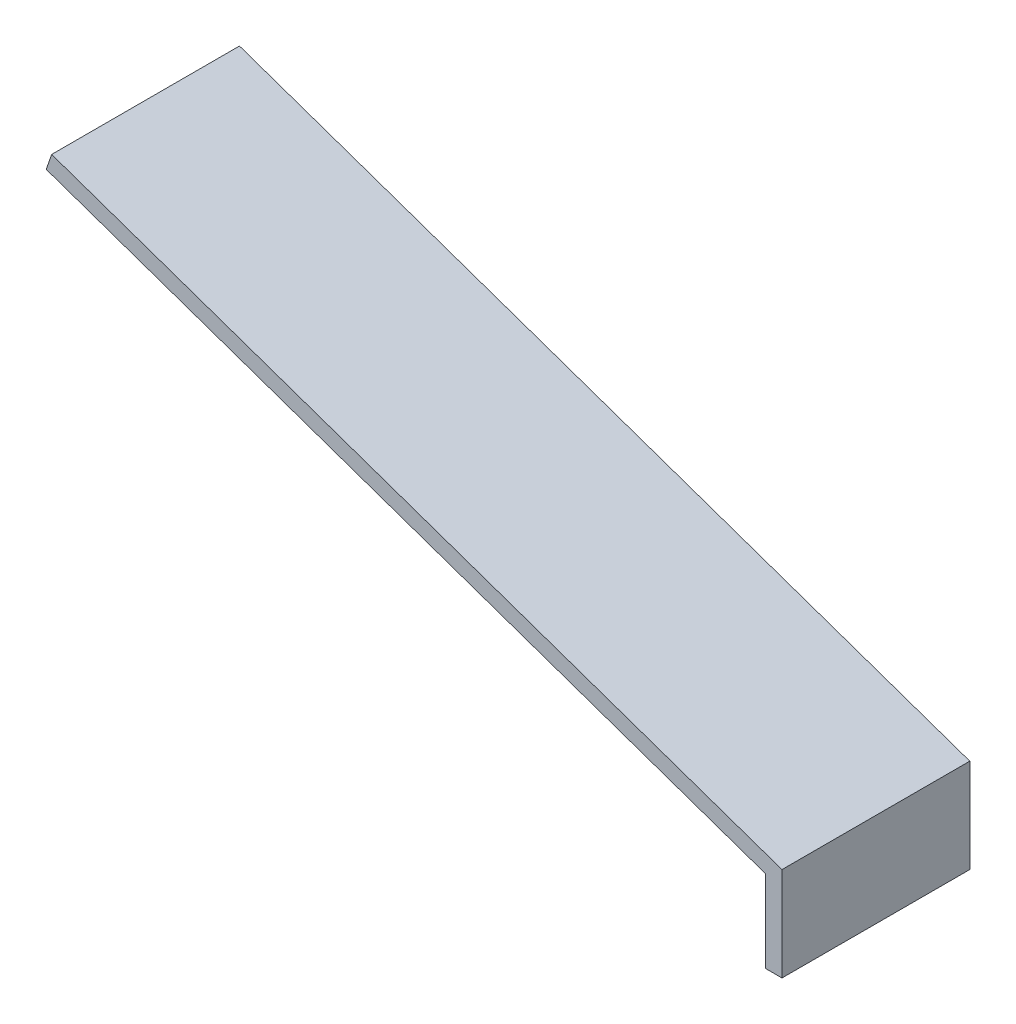
ISO-10303-21;
HEADER;
FILE_DESCRIPTION(('STEP AP214'),'2;1');
FILE_NAME('part.step','',(''),(''),'','','');
FILE_SCHEMA(('AUTOMOTIVE_DESIGN { 1 0 10303 214 1 1 1 1 }'));
ENDSEC;
DATA;
#1=APPLICATION_CONTEXT('core data for automotive mechanical design processes');
#2=APPLICATION_PROTOCOL_DEFINITION('international standard','automotive_design',2000,#1);
#3=PRODUCT_CONTEXT('',#1,'mechanical');
#4=PRODUCT('Part','Part','',(#3));
#5=PRODUCT_RELATED_PRODUCT_CATEGORY('part','',(#4));
#6=PRODUCT_DEFINITION_FORMATION('','',#4);
#7=PRODUCT_DEFINITION_CONTEXT('part definition',#1,'design');
#8=PRODUCT_DEFINITION('design','',#6,#7);
#9=PRODUCT_DEFINITION_SHAPE('','',#8);
#10=(LENGTH_UNIT() NAMED_UNIT(*) SI_UNIT(.MILLI.,.METRE.));
#11=(NAMED_UNIT(*) PLANE_ANGLE_UNIT() SI_UNIT($,.RADIAN.));
#12=(NAMED_UNIT(*) SI_UNIT($,.STERADIAN.) SOLID_ANGLE_UNIT());
#13=UNCERTAINTY_MEASURE_WITH_UNIT(LENGTH_MEASURE(1.E-05),#10,'distance_accuracy_value','');
#14=(GEOMETRIC_REPRESENTATION_CONTEXT(3) GLOBAL_UNCERTAINTY_ASSIGNED_CONTEXT((#13)) GLOBAL_UNIT_ASSIGNED_CONTEXT((#10,
#11,#12)) REPRESENTATION_CONTEXT('',''));
#15=CARTESIAN_POINT('',(0.,0.,0.));
#16=DIRECTION('',(0.,0.,1.));
#17=DIRECTION('',(1.,0.,0.));
#18=AXIS2_PLACEMENT_3D('',#15,#16,#17);
#19=CARTESIAN_POINT('',(0.,0.,2.1));
#20=DIRECTION('',(0.,-1.,0.));
#21=DIRECTION('',(0.,0.,-1.));
#22=AXIS2_PLACEMENT_3D('',#19,#20,#21);
#23=PLANE('',#22);
#24=DIRECTION('',(-1.,0.,0.));
#25=VECTOR('',#24,1.);
#26=CARTESIAN_POINT('',(0.,0.,-1.7000000000001));
#27=LINE('',#26,#25);
#28=CARTESIAN_POINT('',(0.300000000000014,0.,-1.7000000000001));
#29=VERTEX_POINT('',#28);
#30=CARTESIAN_POINT('',(0.,0.,-1.7000000000001));
#31=VERTEX_POINT('',#30);
#32=EDGE_CURVE('E33',#29,#31,#27,.T.);
#33=ORIENTED_EDGE('',*,*,#32,.F.);
#34=DIRECTION('',(0.,0.,-1.));
#35=VECTOR('',#34,1.);
#36=CARTESIAN_POINT('',(0.299999999999986,0.,2.1));
#37=LINE('',#36,#35);
#38=CARTESIAN_POINT('',(0.300000000000014,0.,1.69999999999989));
#39=VERTEX_POINT('',#38);
#40=EDGE_CURVE('E99',#39,#29,#37,.T.);
#41=ORIENTED_EDGE('',*,*,#40,.F.);
#42=DIRECTION('',(1.,0.,0.));
#43=VECTOR('',#42,1.);
#44=CARTESIAN_POINT('',(0.,0.,1.69999999999989));
#45=LINE('',#44,#43);
#46=CARTESIAN_POINT('',(0.,0.,1.69999999999989));
#47=VERTEX_POINT('',#46);
#48=EDGE_CURVE('E112',#47,#39,#45,.T.);
#49=ORIENTED_EDGE('',*,*,#48,.F.);
#50=DIRECTION('',(0.,0.,-1.));
#51=VECTOR('',#50,1.);
#52=CARTESIAN_POINT('',(0.,0.,2.1));
#53=LINE('',#52,#51);
#54=EDGE_CURVE('E93',#47,#31,#53,.T.);
#55=ORIENTED_EDGE('',*,*,#54,.T.);
#56=EDGE_LOOP('',(#33,#41,#49,#55));
#57=FACE_BOUND('',#56,.T.);
#58=ADVANCED_FACE('F19',(#57),#23,.T.);
#59=CARTESIAN_POINT('',(0.299999999999986,1.7,2.1));
#60=DIRECTION('',(1.,0.,0.));
#61=DIRECTION('',(0.,0.,-1.));
#62=AXIS2_PLACEMENT_3D('',#59,#60,#61);
#63=PLANE('',#62);
#64=DIRECTION('',(0.,-1.,0.));
#65=VECTOR('',#64,1.);
#66=CARTESIAN_POINT('',(0.300000000000012,1.7,-1.7000000000001));
#67=LINE('',#66,#65);
#68=CARTESIAN_POINT('',(0.300000000000012,1.7,-1.7000000000001));
#69=VERTEX_POINT('',#68);
#70=EDGE_CURVE('E120',#69,#29,#67,.T.);
#71=ORIENTED_EDGE('',*,*,#70,.F.);
#72=DIRECTION('',(0.,0.,-1.));
#73=VECTOR('',#72,1.);
#74=CARTESIAN_POINT('',(0.299999999999986,1.7,2.1));
#75=LINE('',#74,#73);
#76=CARTESIAN_POINT('',(0.299999999999988,1.7,1.6999999999999));
#77=VERTEX_POINT('',#76);
#78=EDGE_CURVE('E91',#77,#69,#75,.T.);
#79=ORIENTED_EDGE('',*,*,#78,.F.);
#80=DIRECTION('',(0.,1.,0.));
#81=VECTOR('',#80,1.);
#82=CARTESIAN_POINT('',(0.299999999999988,1.7,1.6999999999999));
#83=LINE('',#82,#81);
#84=EDGE_CURVE('E110',#39,#77,#83,.T.);
#85=ORIENTED_EDGE('',*,*,#84,.F.);
#86=ORIENTED_EDGE('',*,*,#40,.T.);
#87=EDGE_LOOP('',(#71,#79,#85,#86));
#88=FACE_BOUND('',#87,.T.);
#89=ADVANCED_FACE('F146',(#88),#63,.T.);
#90=CARTESIAN_POINT('',(-12.9220725547592,6.30182543744157,2.09999999999991));
#91=DIRECTION('',(0.328701816960112,0.944433753911369,0.));
#92=DIRECTION('',(-0.944433753911369,0.328701816960112,0.));
#93=AXIS2_PLACEMENT_3D('',#90,#91,#92);
#94=PLANE('',#93);
#95=DIRECTION('',(0.944433753911369,-0.328701816960112,0.));
#96=VECTOR('',#95,1.);
#97=CARTESIAN_POINT('',(-12.9220725547592,6.30182543744158,-1.70000000000009));
#98=LINE('',#97,#96);
#99=CARTESIAN_POINT('',(-12.9220725547592,6.30182543744158,-1.70000000000009));
#100=VERTEX_POINT('',#99);
#101=EDGE_CURVE('E117',#100,#69,#98,.T.);
#102=ORIENTED_EDGE('',*,*,#101,.F.);
#103=DIRECTION('',(0.,0.,-1.));
#104=VECTOR('',#103,1.);
#105=CARTESIAN_POINT('',(-12.9220725547592,6.30182543744157,2.09999999999991));
#106=LINE('',#105,#104);
#107=CARTESIAN_POINT('',(-12.9220725547592,6.30182543744157,1.69999999999991));
#108=VERTEX_POINT('',#107);
#109=EDGE_CURVE('E86',#108,#100,#106,.T.);
#110=ORIENTED_EDGE('',*,*,#109,.F.);
#111=DIRECTION('',(-0.944433753911369,0.328701816960112,0.));
#112=VECTOR('',#111,1.);
#113=CARTESIAN_POINT('',(-12.9220725547592,6.30182543744157,1.69999999999991));
#114=LINE('',#113,#112);
#115=EDGE_CURVE('E98',#77,#108,#114,.T.);
#116=ORIENTED_EDGE('',*,*,#115,.F.);
#117=ORIENTED_EDGE('',*,*,#78,.T.);
#118=EDGE_LOOP('',(#102,#110,#116,#117));
#119=FACE_BOUND('',#118,.T.);
#120=ADVANCED_FACE('F150',(#119),#94,.T.);
#121=CARTESIAN_POINT('',(-13.0206830998472,6.01849531126816,2.09999999999991));
#122=DIRECTION('',(-0.944433753911369,0.328701816960113,0.));
#123=DIRECTION('',(-0.328701816960113,-0.944433753911369,0.));
#124=AXIS2_PLACEMENT_3D('',#121,#122,#123);
#125=PLANE('',#124);
#126=DIRECTION('',(0.328701816960112,0.944433753911369,0.));
#127=VECTOR('',#126,1.);
#128=CARTESIAN_POINT('',(-16.7678838131925,-4.74804948332144,-1.70000000000011));
#129=LINE('',#128,#127);
#130=CARTESIAN_POINT('',(-13.0206830998472,6.01849531126817,-1.70000000000009));
#131=VERTEX_POINT('',#130);
#132=EDGE_CURVE('E72',#131,#100,#129,.T.);
#133=ORIENTED_EDGE('',*,*,#132,.F.);
#134=DIRECTION('',(0.,0.,-1.));
#135=VECTOR('',#134,1.);
#136=CARTESIAN_POINT('',(-13.0206830998472,6.01849531126816,2.09999999999991));
#137=LINE('',#136,#135);
#138=CARTESIAN_POINT('',(-13.0206830998472,6.01849531126816,1.69999999999991));
#139=VERTEX_POINT('',#138);
#140=EDGE_CURVE('E84',#139,#131,#137,.T.);
#141=ORIENTED_EDGE('',*,*,#140,.F.);
#142=DIRECTION('',(0.328701816960112,0.944433753911369,0.));
#143=VECTOR('',#142,1.);
#144=CARTESIAN_POINT('',(-16.7678838131925,-4.74804948332145,1.69999999999988));
#145=LINE('',#144,#143);
#146=EDGE_CURVE('E115',#139,#108,#145,.T.);
#147=ORIENTED_EDGE('',*,*,#146,.T.);
#148=ORIENTED_EDGE('',*,*,#109,.T.);
#149=EDGE_LOOP('',(#133,#141,#147,#148));
#150=FACE_BOUND('',#149,.T.);
#151=ADVANCED_FACE('F82',(#150),#125,.T.);
#152=CARTESIAN_POINT('',(0.,1.48676169283667,2.1));
#153=DIRECTION('',(-0.328701816960112,-0.944433753911369,0.));
#154=DIRECTION('',(0.944433753911369,-0.328701816960112,0.));
#155=AXIS2_PLACEMENT_3D('',#152,#153,#154);
#156=PLANE('',#155);
#157=DIRECTION('',(-0.944433753911369,0.328701816960112,0.));
#158=VECTOR('',#157,1.);
#159=CARTESIAN_POINT('',(0.,1.48676169283668,-1.7000000000001));
#160=LINE('',#159,#158);
#161=CARTESIAN_POINT('',(0.,1.48676169283667,-1.7000000000001));
#162=VERTEX_POINT('',#161);
#163=EDGE_CURVE('E69',#162,#131,#160,.T.);
#164=ORIENTED_EDGE('',*,*,#163,.F.);
#165=DIRECTION('',(0.,0.,-1.));
#166=VECTOR('',#165,1.);
#167=CARTESIAN_POINT('',(0.,1.48676169283667,2.1));
#168=LINE('',#167,#166);
#169=CARTESIAN_POINT('',(0.,1.48676169283667,1.6999999999999));
#170=VERTEX_POINT('',#169);
#171=EDGE_CURVE('E89',#170,#162,#168,.T.);
#172=ORIENTED_EDGE('',*,*,#171,.F.);
#173=DIRECTION('',(0.944433753911369,-0.328701816960112,0.));
#174=VECTOR('',#173,1.);
#175=CARTESIAN_POINT('',(0.,1.48676169283667,1.6999999999999));
#176=LINE('',#175,#174);
#177=EDGE_CURVE('E41',#139,#170,#176,.T.);
#178=ORIENTED_EDGE('',*,*,#177,.F.);
#179=ORIENTED_EDGE('',*,*,#140,.T.);
#180=EDGE_LOOP('',(#164,#172,#178,#179));
#181=FACE_BOUND('',#180,.T.);
#182=ADVANCED_FACE('F88',(#181),#156,.T.);
#183=CARTESIAN_POINT('',(0.,1.48676169283667,2.1));
#184=DIRECTION('',(-1.,0.,0.));
#185=DIRECTION('',(0.,0.,1.));
#186=AXIS2_PLACEMENT_3D('',#183,#184,#185);
#187=PLANE('',#186);
#188=DIRECTION('',(0.,1.,0.));
#189=VECTOR('',#188,1.);
#190=CARTESIAN_POINT('',(0.,1.48676169283668,-1.7000000000001));
#191=LINE('',#190,#189);
#192=EDGE_CURVE('E12',#31,#162,#191,.T.);
#193=ORIENTED_EDGE('',*,*,#192,.F.);
#194=ORIENTED_EDGE('',*,*,#54,.F.);
#195=DIRECTION('',(0.,-1.,0.));
#196=VECTOR('',#195,1.);
#197=CARTESIAN_POINT('',(0.,1.48676169283667,1.6999999999999));
#198=LINE('',#197,#196);
#199=EDGE_CURVE('E27',#170,#47,#198,.T.);
#200=ORIENTED_EDGE('',*,*,#199,.F.);
#201=ORIENTED_EDGE('',*,*,#171,.T.);
#202=EDGE_LOOP('',(#193,#194,#200,#201));
#203=FACE_BOUND('',#202,.T.);
#204=ADVANCED_FACE('F135',(#203),#187,.T.);
#205=CARTESIAN_POINT('',(-16.7678838131925,-4.74804948332145,1.69999999999988));
#206=DIRECTION('',(0.,0.,-1.));
#207=DIRECTION('',(0.,1.,0.));
#208=AXIS2_PLACEMENT_3D('',#205,#206,#207);
#209=PLANE('',#208);
#210=ORIENTED_EDGE('',*,*,#115,.T.);
#211=ORIENTED_EDGE('',*,*,#146,.F.);
#212=ORIENTED_EDGE('',*,*,#177,.T.);
#213=ORIENTED_EDGE('',*,*,#199,.T.);
#214=ORIENTED_EDGE('',*,*,#48,.T.);
#215=ORIENTED_EDGE('',*,*,#84,.T.);
#216=EDGE_LOOP('',(#210,#211,#212,#213,#214,#215));
#217=FACE_BOUND('',#216,.T.);
#218=ADVANCED_FACE('F137',(#217),#209,.F.);
#219=CARTESIAN_POINT('',(-16.7678838131925,-4.74804948332144,-1.70000000000011));
#220=DIRECTION('',(0.,0.,1.));
#221=DIRECTION('',(0.,-1.,0.));
#222=AXIS2_PLACEMENT_3D('',#219,#220,#221);
#223=PLANE('',#222);
#224=ORIENTED_EDGE('',*,*,#101,.T.);
#225=ORIENTED_EDGE('',*,*,#70,.T.);
#226=ORIENTED_EDGE('',*,*,#32,.T.);
#227=ORIENTED_EDGE('',*,*,#192,.T.);
#228=ORIENTED_EDGE('',*,*,#163,.T.);
#229=ORIENTED_EDGE('',*,*,#132,.T.);
#230=EDGE_LOOP('',(#224,#225,#226,#227,#228,#229));
#231=FACE_BOUND('',#230,.T.);
#232=ADVANCED_FACE('F71',(#231),#223,.F.);
#233=CLOSED_SHELL('',(#58,#89,#120,#151,#182,#204,#218,#232));
#234=MANIFOLD_SOLID_BREP('B1',#233);
#235=ADVANCED_BREP_SHAPE_REPRESENTATION('',(#18,#234),#14);
#236=SHAPE_DEFINITION_REPRESENTATION(#9,#235);
ENDSEC;
END-ISO-10303-21;
